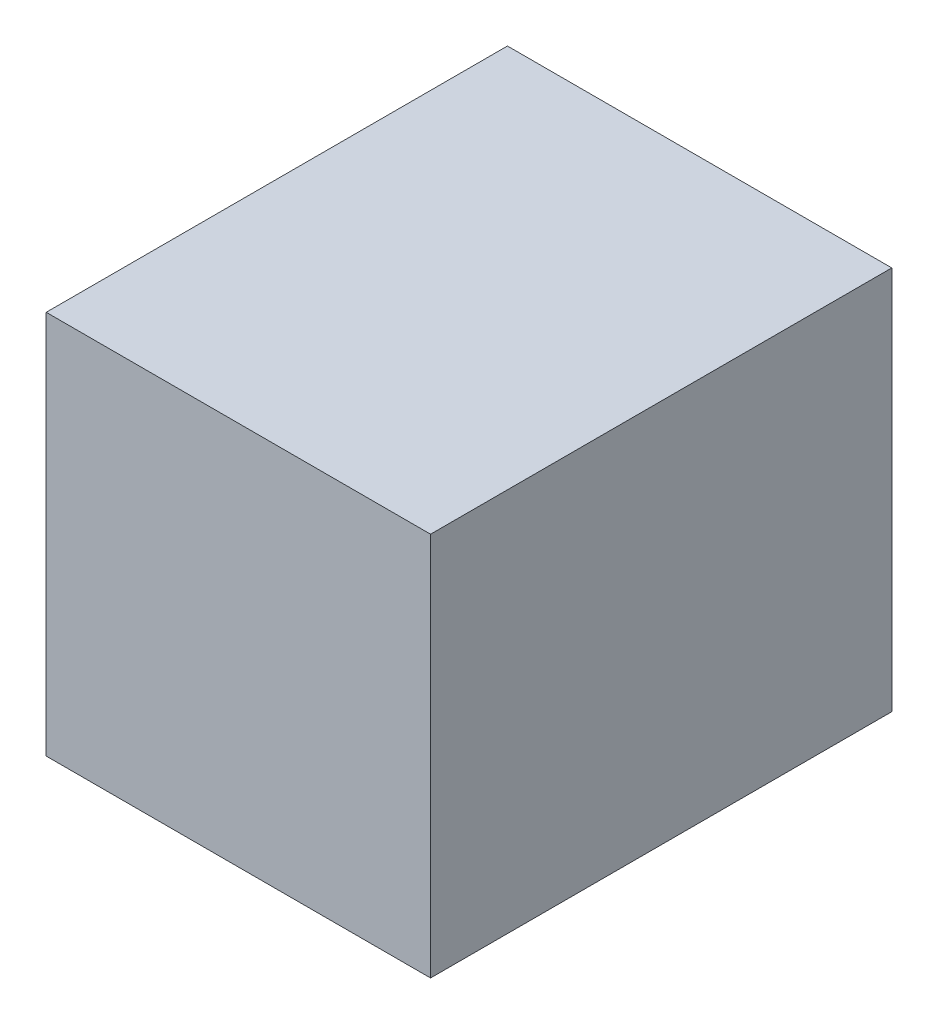
ISO-10303-21;
HEADER;
FILE_DESCRIPTION(('STEP AP214'),'2;1');
FILE_NAME('part.step','',(''),(''),'','','');
FILE_SCHEMA(('AUTOMOTIVE_DESIGN { 1 0 10303 214 1 1 1 1 }'));
ENDSEC;
DATA;
#1=APPLICATION_CONTEXT('core data for automotive mechanical design processes');
#2=APPLICATION_PROTOCOL_DEFINITION('international standard','automotive_design',2000,#1);
#3=PRODUCT_CONTEXT('',#1,'mechanical');
#4=PRODUCT('Part','Part','',(#3));
#5=PRODUCT_RELATED_PRODUCT_CATEGORY('part','',(#4));
#6=PRODUCT_DEFINITION_FORMATION('','',#4);
#7=PRODUCT_DEFINITION_CONTEXT('part definition',#1,'design');
#8=PRODUCT_DEFINITION('design','',#6,#7);
#9=PRODUCT_DEFINITION_SHAPE('','',#8);
#10=(LENGTH_UNIT() NAMED_UNIT(*) SI_UNIT(.MILLI.,.METRE.));
#11=(NAMED_UNIT(*) PLANE_ANGLE_UNIT() SI_UNIT($,.RADIAN.));
#12=(NAMED_UNIT(*) SI_UNIT($,.STERADIAN.) SOLID_ANGLE_UNIT());
#13=UNCERTAINTY_MEASURE_WITH_UNIT(LENGTH_MEASURE(1.E-05),#10,'distance_accuracy_value','');
#14=(GEOMETRIC_REPRESENTATION_CONTEXT(3) GLOBAL_UNCERTAINTY_ASSIGNED_CONTEXT((#13)) GLOBAL_UNIT_ASSIGNED_CONTEXT((#10,
#11,#12)) REPRESENTATION_CONTEXT('',''));
#15=CARTESIAN_POINT('',(0.,0.,0.));
#16=DIRECTION('',(0.,0.,1.));
#17=DIRECTION('',(1.,0.,0.));
#18=AXIS2_PLACEMENT_3D('',#15,#16,#17);
#19=CARTESIAN_POINT('',(0.,0.,24.9003841816037));
#20=DIRECTION('',(1.,0.,0.));
#21=DIRECTION('',(0.,1.,0.));
#22=AXIS2_PLACEMENT_3D('',#19,#20,#21);
#23=PLANE('',#22);
#24=DIRECTION('',(0.,-1.,0.));
#25=VECTOR('',#24,1.);
#26=CARTESIAN_POINT('',(0.,0.,11.43));
#27=LINE('',#26,#25);
#28=CARTESIAN_POINT('',(0.,9.525,11.43));
#29=VERTEX_POINT('',#28);
#30=CARTESIAN_POINT('',(0.,0.,11.43));
#31=VERTEX_POINT('',#30);
#32=EDGE_CURVE('E83',#29,#31,#27,.T.);
#33=ORIENTED_EDGE('',*,*,#32,.F.);
#34=DIRECTION('',(0.,0.,-1.));
#35=VECTOR('',#34,1.);
#36=CARTESIAN_POINT('',(0.,9.525,24.9003841816037));
#37=LINE('',#36,#35);
#38=CARTESIAN_POINT('',(0.,9.525,0.));
#39=VERTEX_POINT('',#38);
#40=EDGE_CURVE('E37',#29,#39,#37,.T.);
#41=ORIENTED_EDGE('',*,*,#40,.T.);
#42=DIRECTION('',(0.,-1.,0.));
#43=VECTOR('',#42,1.);
#44=CARTESIAN_POINT('',(0.,0.,0.));
#45=LINE('',#44,#43);
#46=CARTESIAN_POINT('',(0.,0.,0.));
#47=VERTEX_POINT('',#46);
#48=EDGE_CURVE('E81',#39,#47,#45,.T.);
#49=ORIENTED_EDGE('',*,*,#48,.T.);
#50=DIRECTION('',(0.,0.,-1.));
#51=VECTOR('',#50,1.);
#52=CARTESIAN_POINT('',(0.,0.,24.9003841816037));
#53=LINE('',#52,#51);
#54=EDGE_CURVE('E72',#31,#47,#53,.T.);
#55=ORIENTED_EDGE('',*,*,#54,.F.);
#56=EDGE_LOOP('',(#33,#41,#49,#55));
#57=FACE_BOUND('',#56,.T.);
#58=ADVANCED_FACE('F33',(#57),#23,.F.);
#59=CARTESIAN_POINT('',(0.,0.,24.9003841816037));
#60=DIRECTION('',(0.,1.,0.));
#61=DIRECTION('',(0.,0.,1.));
#62=AXIS2_PLACEMENT_3D('',#59,#60,#61);
#63=PLANE('',#62);
#64=DIRECTION('',(1.,0.,0.));
#65=VECTOR('',#64,1.);
#66=CARTESIAN_POINT('',(0.,0.,11.43));
#67=LINE('',#66,#65);
#68=CARTESIAN_POINT('',(9.525,0.,11.43));
#69=VERTEX_POINT('',#68);
#70=EDGE_CURVE('E42',#31,#69,#67,.T.);
#71=ORIENTED_EDGE('',*,*,#70,.F.);
#72=ORIENTED_EDGE('',*,*,#54,.T.);
#73=DIRECTION('',(1.,0.,0.));
#74=VECTOR('',#73,1.);
#75=CARTESIAN_POINT('',(0.,0.,0.));
#76=LINE('',#75,#74);
#77=CARTESIAN_POINT('',(9.525,0.,0.));
#78=VERTEX_POINT('',#77);
#79=EDGE_CURVE('E93',#47,#78,#76,.T.);
#80=ORIENTED_EDGE('',*,*,#79,.T.);
#81=DIRECTION('',(0.,0.,-1.));
#82=VECTOR('',#81,1.);
#83=CARTESIAN_POINT('',(9.525,0.,24.9003841816037));
#84=LINE('',#83,#82);
#85=EDGE_CURVE('E102',#69,#78,#84,.T.);
#86=ORIENTED_EDGE('',*,*,#85,.F.);
#87=EDGE_LOOP('',(#71,#72,#80,#86));
#88=FACE_BOUND('',#87,.T.);
#89=ADVANCED_FACE('F106',(#88),#63,.F.);
#90=CARTESIAN_POINT('',(9.525,0.,24.9003841816037));
#91=DIRECTION('',(-1.,0.,0.));
#92=DIRECTION('',(0.,-1.,0.));
#93=AXIS2_PLACEMENT_3D('',#90,#91,#92);
#94=PLANE('',#93);
#95=DIRECTION('',(0.,1.,0.));
#96=VECTOR('',#95,1.);
#97=CARTESIAN_POINT('',(9.525,0.,11.43));
#98=LINE('',#97,#96);
#99=CARTESIAN_POINT('',(9.525,9.525,11.43));
#100=VERTEX_POINT('',#99);
#101=EDGE_CURVE('E11',#69,#100,#98,.T.);
#102=ORIENTED_EDGE('',*,*,#101,.F.);
#103=ORIENTED_EDGE('',*,*,#85,.T.);
#104=DIRECTION('',(0.,1.,0.));
#105=VECTOR('',#104,1.);
#106=CARTESIAN_POINT('',(9.525,0.,0.));
#107=LINE('',#106,#105);
#108=CARTESIAN_POINT('',(9.525,9.525,0.));
#109=VERTEX_POINT('',#108);
#110=EDGE_CURVE('E103',#78,#109,#107,.T.);
#111=ORIENTED_EDGE('',*,*,#110,.T.);
#112=DIRECTION('',(0.,0.,-1.));
#113=VECTOR('',#112,1.);
#114=CARTESIAN_POINT('',(9.525,9.525,24.9003841816037));
#115=LINE('',#114,#113);
#116=EDGE_CURVE('E55',#100,#109,#115,.T.);
#117=ORIENTED_EDGE('',*,*,#116,.F.);
#118=EDGE_LOOP('',(#102,#103,#111,#117));
#119=FACE_BOUND('',#118,.T.);
#120=ADVANCED_FACE('F105',(#119),#94,.F.);
#121=CARTESIAN_POINT('',(0.,9.525,24.9003841816037));
#122=DIRECTION('',(0.,-1.,0.));
#123=DIRECTION('',(0.,0.,-1.));
#124=AXIS2_PLACEMENT_3D('',#121,#122,#123);
#125=PLANE('',#124);
#126=DIRECTION('',(-1.,0.,0.));
#127=VECTOR('',#126,1.);
#128=CARTESIAN_POINT('',(0.,9.525,11.43));
#129=LINE('',#128,#127);
#130=EDGE_CURVE('E90',#100,#29,#129,.T.);
#131=ORIENTED_EDGE('',*,*,#130,.F.);
#132=ORIENTED_EDGE('',*,*,#116,.T.);
#133=DIRECTION('',(-1.,0.,0.));
#134=VECTOR('',#133,1.);
#135=CARTESIAN_POINT('',(0.,9.525,0.));
#136=LINE('',#135,#134);
#137=EDGE_CURVE('E86',#109,#39,#136,.T.);
#138=ORIENTED_EDGE('',*,*,#137,.T.);
#139=ORIENTED_EDGE('',*,*,#40,.F.);
#140=EDGE_LOOP('',(#131,#132,#138,#139));
#141=FACE_BOUND('',#140,.T.);
#142=ADVANCED_FACE('F87',(#141),#125,.F.);
#143=CARTESIAN_POINT('',(0.,0.,0.));
#144=DIRECTION('',(0.,0.,-1.));
#145=DIRECTION('',(-1.,0.,0.));
#146=AXIS2_PLACEMENT_3D('',#143,#144,#145);
#147=PLANE('',#146);
#148=ORIENTED_EDGE('',*,*,#48,.F.);
#149=ORIENTED_EDGE('',*,*,#137,.F.);
#150=ORIENTED_EDGE('',*,*,#110,.F.);
#151=ORIENTED_EDGE('',*,*,#79,.F.);
#152=EDGE_LOOP('',(#148,#149,#150,#151));
#153=FACE_BOUND('',#152,.T.);
#154=ADVANCED_FACE('F92',(#153),#147,.T.);
#155=CARTESIAN_POINT('',(4.7625,-10.8297698427832,11.43));
#156=DIRECTION('',(0.,0.,1.));
#157=DIRECTION('',(1.,0.,0.));
#158=AXIS2_PLACEMENT_3D('',#155,#156,#157);
#159=PLANE('',#158);
#160=ORIENTED_EDGE('',*,*,#130,.T.);
#161=ORIENTED_EDGE('',*,*,#32,.T.);
#162=ORIENTED_EDGE('',*,*,#70,.T.);
#163=ORIENTED_EDGE('',*,*,#101,.T.);
#164=EDGE_LOOP('',(#160,#161,#162,#163));
#165=FACE_BOUND('',#164,.T.);
#166=ADVANCED_FACE('F35',(#165),#159,.T.);
#167=CLOSED_SHELL('',(#58,#89,#120,#142,#154,#166));
#168=MANIFOLD_SOLID_BREP('B2',#167);
#169=ADVANCED_BREP_SHAPE_REPRESENTATION('',(#18,#168),#14);
#170=SHAPE_DEFINITION_REPRESENTATION(#9,#169);
ENDSEC;
END-ISO-10303-21;
